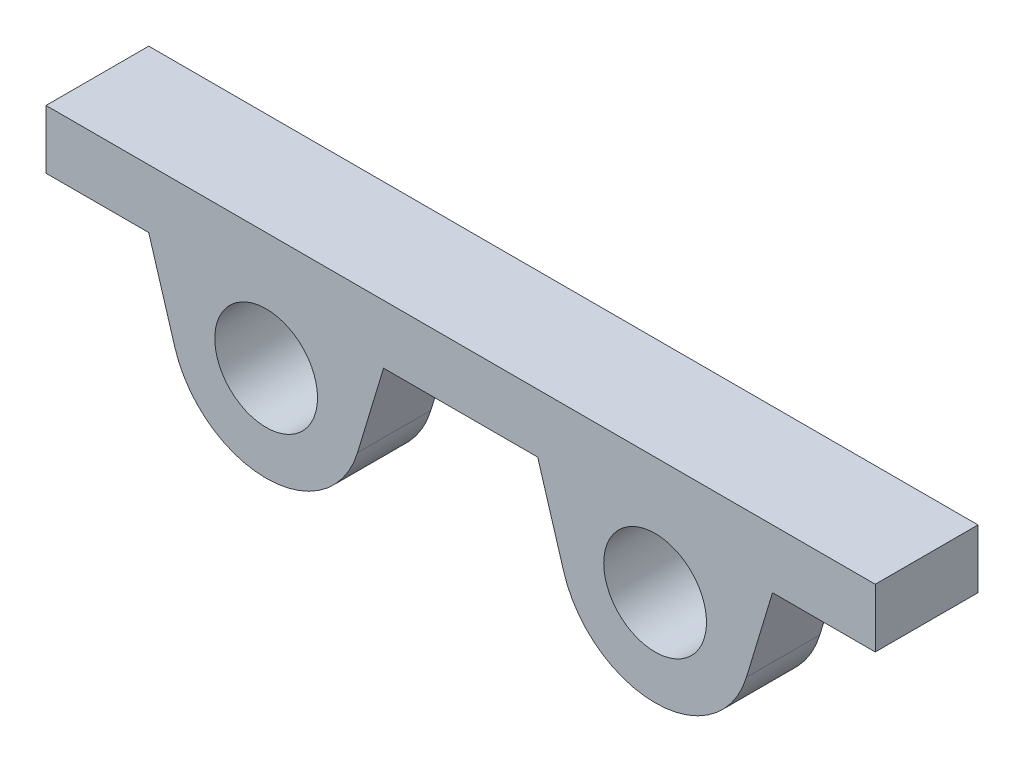
ISO-10303-21;
HEADER;
FILE_DESCRIPTION(('STEP AP214'),'2;1');
FILE_NAME('part.step','',(''),(''),'','','');
FILE_SCHEMA(('AUTOMOTIVE_DESIGN { 1 0 10303 214 1 1 1 1 }'));
ENDSEC;
DATA;
#1=APPLICATION_CONTEXT('core data for automotive mechanical design processes');
#2=APPLICATION_PROTOCOL_DEFINITION('international standard','automotive_design',2000,#1);
#3=PRODUCT_CONTEXT('',#1,'mechanical');
#4=PRODUCT('Part','Part','',(#3));
#5=PRODUCT_RELATED_PRODUCT_CATEGORY('part','',(#4));
#6=PRODUCT_DEFINITION_FORMATION('','',#4);
#7=PRODUCT_DEFINITION_CONTEXT('part definition',#1,'design');
#8=PRODUCT_DEFINITION('design','',#6,#7);
#9=PRODUCT_DEFINITION_SHAPE('','',#8);
#10=(LENGTH_UNIT() NAMED_UNIT(*) SI_UNIT(.MILLI.,.METRE.));
#11=(NAMED_UNIT(*) PLANE_ANGLE_UNIT() SI_UNIT($,.RADIAN.));
#12=(NAMED_UNIT(*) SI_UNIT($,.STERADIAN.) SOLID_ANGLE_UNIT());
#13=UNCERTAINTY_MEASURE_WITH_UNIT(LENGTH_MEASURE(1.E-05),#10,'distance_accuracy_value','');
#14=(GEOMETRIC_REPRESENTATION_CONTEXT(3) GLOBAL_UNCERTAINTY_ASSIGNED_CONTEXT((#13)) GLOBAL_UNIT_ASSIGNED_CONTEXT((#10,
#11,#12)) REPRESENTATION_CONTEXT('',''));
#15=CARTESIAN_POINT('',(0.,0.,0.));
#16=DIRECTION('',(0.,0.,1.));
#17=DIRECTION('',(1.,0.,0.));
#18=AXIS2_PLACEMENT_3D('',#15,#16,#17);
#19=CARTESIAN_POINT('',(-13.25,0.,-5.));
#20=DIRECTION('',(0.,0.,-1.));
#21=DIRECTION('',(1.,0.,0.));
#22=AXIS2_PLACEMENT_3D('',#19,#20,#21);
#23=PLANE('',#22);
#24=DIRECTION('',(1.,0.,0.));
#25=VECTOR('',#24,1.);
#26=CARTESIAN_POINT('',(28.25,4.,-5.));
#27=LINE('',#26,#25);
#28=CARTESIAN_POINT('',(-21.25,4.,-5.));
#29=VERTEX_POINT('',#28);
#30=CARTESIAN_POINT('',(-5.25,4.,-5.));
#31=VERTEX_POINT('',#30);
#32=EDGE_CURVE('E11',#29,#31,#27,.T.);
#33=ORIENTED_EDGE('',*,*,#32,.T.);
#34=DIRECTION('',(0.289410286372225,0.957205143186113,0.));
#35=VECTOR('',#34,1.);
#36=CARTESIAN_POINT('',(-7.02816656929026,-1.88116686141946,-5.));
#37=LINE('',#36,#35);
#38=CARTESIAN_POINT('',(-7.02816656929026,-1.88116686141946,-5.));
#39=VERTEX_POINT('',#38);
#40=EDGE_CURVE('E177',#39,#31,#37,.T.);
#41=ORIENTED_EDGE('',*,*,#40,.F.);
#42=CARTESIAN_POINT('',(-13.25,0.,-5.));
#43=DIRECTION('',(0.,0.,1.));
#44=DIRECTION('',(1.,0.,0.));
#45=AXIS2_PLACEMENT_3D('',#42,#43,#44);
#46=CIRCLE('',#45,6.5);
#47=CARTESIAN_POINT('',(-19.4718334307097,-1.88116686141946,-5.));
#48=VERTEX_POINT('',#47);
#49=EDGE_CURVE('E175',#48,#39,#46,.T.);
#50=ORIENTED_EDGE('',*,*,#49,.F.);
#51=DIRECTION('',(0.289410286372225,-0.957205143186113,0.));
#52=VECTOR('',#51,1.);
#53=CARTESIAN_POINT('',(-21.25,4.,-5.));
#54=LINE('',#53,#52);
#55=EDGE_CURVE('E141',#29,#48,#54,.T.);
#56=ORIENTED_EDGE('',*,*,#55,.F.);
#57=EDGE_LOOP('',(#33,#41,#50,#56));
#58=FACE_BOUND('',#57,.T.);
#59=CARTESIAN_POINT('',(-13.25,0.,-5.));
#60=DIRECTION('',(0.,0.,1.));
#61=DIRECTION('',(1.,0.,0.));
#62=AXIS2_PLACEMENT_3D('',#59,#60,#61);
#63=CIRCLE('',#62,3.5);
#64=CARTESIAN_POINT('',(-9.75,0.,-5.));
#65=VERTEX_POINT('',#64);
#66=EDGE_CURVE('E169',#65,#65,#63,.T.);
#67=ORIENTED_EDGE('',*,*,#66,.T.);
#68=EDGE_LOOP('',(#67));
#69=FACE_BOUND('',#68,.T.);
#70=ADVANCED_FACE('F35',(#58,#69),#23,.T.);
#71=CARTESIAN_POINT('',(5.25,4.,-5.));
#72=VERTEX_POINT('',#71);
#73=CARTESIAN_POINT('',(21.25,4.,-5.));
#74=VERTEX_POINT('',#73);
#75=EDGE_CURVE('E45',#72,#74,#27,.T.);
#76=ORIENTED_EDGE('',*,*,#75,.T.);
#77=DIRECTION('',(0.289410286372225,0.957205143186113,0.));
#78=VECTOR('',#77,1.);
#79=CARTESIAN_POINT('',(21.25,4.,-5.));
#80=LINE('',#79,#78);
#81=CARTESIAN_POINT('',(19.4718334307097,-1.88116686141946,-5.));
#82=VERTEX_POINT('',#81);
#83=EDGE_CURVE('E136',#82,#74,#80,.T.);
#84=ORIENTED_EDGE('',*,*,#83,.F.);
#85=CARTESIAN_POINT('',(13.25,0.,-5.));
#86=DIRECTION('',(0.,0.,1.));
#87=DIRECTION('',(-1.,0.,0.));
#88=AXIS2_PLACEMENT_3D('',#85,#86,#87);
#89=CIRCLE('',#88,6.5);
#90=CARTESIAN_POINT('',(7.02816656929026,-1.88116686141946,-5.));
#91=VERTEX_POINT('',#90);
#92=EDGE_CURVE('E142',#91,#82,#89,.T.);
#93=ORIENTED_EDGE('',*,*,#92,.F.);
#94=DIRECTION('',(0.289410286372225,-0.957205143186113,0.));
#95=VECTOR('',#94,1.);
#96=CARTESIAN_POINT('',(7.02816656929026,-1.88116686141946,-5.));
#97=LINE('',#96,#95);
#98=EDGE_CURVE('E148',#72,#91,#97,.T.);
#99=ORIENTED_EDGE('',*,*,#98,.F.);
#100=EDGE_LOOP('',(#76,#84,#93,#99));
#101=FACE_BOUND('',#100,.T.);
#102=CARTESIAN_POINT('',(13.25,0.,-5.));
#103=DIRECTION('',(0.,0.,1.));
#104=DIRECTION('',(-1.,0.,0.));
#105=AXIS2_PLACEMENT_3D('',#102,#103,#104);
#106=CIRCLE('',#105,3.5);
#107=CARTESIAN_POINT('',(9.75,0.,-5.));
#108=VERTEX_POINT('',#107);
#109=EDGE_CURVE('E163',#108,#108,#106,.T.);
#110=ORIENTED_EDGE('',*,*,#109,.T.);
#111=EDGE_LOOP('',(#110));
#112=FACE_BOUND('',#111,.T.);
#113=ADVANCED_FACE('F145',(#101,#112),#23,.T.);
#114=CARTESIAN_POINT('',(-13.25,0.,0.));
#115=DIRECTION('',(0.,0.,-1.));
#116=DIRECTION('',(1.,0.,0.));
#117=AXIS2_PLACEMENT_3D('',#114,#115,#116);
#118=PLANE('',#117);
#119=CARTESIAN_POINT('',(-13.25,0.,0.));
#120=DIRECTION('',(0.,0.,1.));
#121=DIRECTION('',(1.,0.,0.));
#122=AXIS2_PLACEMENT_3D('',#119,#120,#121);
#123=CIRCLE('',#122,6.5);
#124=CARTESIAN_POINT('',(-19.4718334307097,-1.88116686141946,0.));
#125=VERTEX_POINT('',#124);
#126=CARTESIAN_POINT('',(-7.02816656929026,-1.88116686141946,0.));
#127=VERTEX_POINT('',#126);
#128=EDGE_CURVE('E172',#125,#127,#123,.T.);
#129=ORIENTED_EDGE('',*,*,#128,.T.);
#130=DIRECTION('',(0.289410286372225,0.957205143186113,0.));
#131=VECTOR('',#130,1.);
#132=CARTESIAN_POINT('',(-7.02816656929026,-1.88116686141946,0.));
#133=LINE('',#132,#131);
#134=CARTESIAN_POINT('',(-5.25,4.,0.));
#135=VERTEX_POINT('',#134);
#136=EDGE_CURVE('E185',#127,#135,#133,.T.);
#137=ORIENTED_EDGE('',*,*,#136,.T.);
#138=DIRECTION('',(1.,0.,0.));
#139=VECTOR('',#138,1.);
#140=CARTESIAN_POINT('',(-5.25,4.,0.));
#141=LINE('',#140,#139);
#142=CARTESIAN_POINT('',(5.25,4.,0.));
#143=VERTEX_POINT('',#142);
#144=EDGE_CURVE('E188',#135,#143,#141,.T.);
#145=ORIENTED_EDGE('',*,*,#144,.T.);
#146=DIRECTION('',(0.289410286372225,-0.957205143186113,0.));
#147=VECTOR('',#146,1.);
#148=CARTESIAN_POINT('',(7.02816656929026,-1.88116686141946,0.));
#149=LINE('',#148,#147);
#150=CARTESIAN_POINT('',(7.02816656929026,-1.88116686141946,0.));
#151=VERTEX_POINT('',#150);
#152=EDGE_CURVE('E191',#143,#151,#149,.T.);
#153=ORIENTED_EDGE('',*,*,#152,.T.);
#154=CARTESIAN_POINT('',(13.25,0.,0.));
#155=DIRECTION('',(0.,0.,1.));
#156=DIRECTION('',(-1.,0.,0.));
#157=AXIS2_PLACEMENT_3D('',#154,#155,#156);
#158=CIRCLE('',#157,6.5);
#159=CARTESIAN_POINT('',(19.4718334307097,-1.88116686141946,0.));
#160=VERTEX_POINT('',#159);
#161=EDGE_CURVE('E194',#151,#160,#158,.T.);
#162=ORIENTED_EDGE('',*,*,#161,.T.);
#163=DIRECTION('',(0.289410286372225,0.957205143186113,0.));
#164=VECTOR('',#163,1.);
#165=CARTESIAN_POINT('',(21.25,4.,0.));
#166=LINE('',#165,#164);
#167=CARTESIAN_POINT('',(21.25,4.,0.));
#168=VERTEX_POINT('',#167);
#169=EDGE_CURVE('E197',#160,#168,#166,.T.);
#170=ORIENTED_EDGE('',*,*,#169,.T.);
#171=DIRECTION('',(1.,0.,0.));
#172=VECTOR('',#171,1.);
#173=CARTESIAN_POINT('',(28.25,4.,0.));
#174=LINE('',#173,#172);
#175=CARTESIAN_POINT('',(28.25,4.,0.));
#176=VERTEX_POINT('',#175);
#177=EDGE_CURVE('E128',#168,#176,#174,.T.);
#178=ORIENTED_EDGE('',*,*,#177,.T.);
#179=DIRECTION('',(0.,1.,0.));
#180=VECTOR('',#179,1.);
#181=CARTESIAN_POINT('',(28.25,8.,0.));
#182=LINE('',#181,#180);
#183=CARTESIAN_POINT('',(28.25,8.,0.));
#184=VERTEX_POINT('',#183);
#185=EDGE_CURVE('E200',#176,#184,#182,.T.);
#186=ORIENTED_EDGE('',*,*,#185,.T.);
#187=DIRECTION('',(-1.,0.,0.));
#188=VECTOR('',#187,1.);
#189=CARTESIAN_POINT('',(28.25,8.,0.));
#190=LINE('',#189,#188);
#191=CARTESIAN_POINT('',(-28.25,8.,0.));
#192=VERTEX_POINT('',#191);
#193=EDGE_CURVE('E203',#184,#192,#190,.T.);
#194=ORIENTED_EDGE('',*,*,#193,.T.);
#195=DIRECTION('',(0.,-1.,0.));
#196=VECTOR('',#195,1.);
#197=CARTESIAN_POINT('',(-28.25,8.,0.));
#198=LINE('',#197,#196);
#199=CARTESIAN_POINT('',(-28.25,4.,0.));
#200=VERTEX_POINT('',#199);
#201=EDGE_CURVE('E206',#192,#200,#198,.T.);
#202=ORIENTED_EDGE('',*,*,#201,.T.);
#203=DIRECTION('',(1.,0.,0.));
#204=VECTOR('',#203,1.);
#205=CARTESIAN_POINT('',(-28.25,4.,0.));
#206=LINE('',#205,#204);
#207=CARTESIAN_POINT('',(-21.25,4.,0.));
#208=VERTEX_POINT('',#207);
#209=EDGE_CURVE('E209',#200,#208,#206,.T.);
#210=ORIENTED_EDGE('',*,*,#209,.T.);
#211=DIRECTION('',(0.289410286372225,-0.957205143186113,0.));
#212=VECTOR('',#211,1.);
#213=CARTESIAN_POINT('',(-21.25,4.,0.));
#214=LINE('',#213,#212);
#215=EDGE_CURVE('E178',#208,#125,#214,.T.);
#216=ORIENTED_EDGE('',*,*,#215,.T.);
#217=EDGE_LOOP('',(#129,#137,#145,#153,#162,#170,#178,#186,#194,#202,#210,#216));
#218=FACE_BOUND('',#217,.T.);
#219=CARTESIAN_POINT('',(-13.25,0.,0.));
#220=DIRECTION('',(0.,0.,1.));
#221=DIRECTION('',(1.,0.,0.));
#222=AXIS2_PLACEMENT_3D('',#219,#220,#221);
#223=CIRCLE('',#222,3.5);
#224=CARTESIAN_POINT('',(-9.75,0.,0.));
#225=VERTEX_POINT('',#224);
#226=EDGE_CURVE('E166',#225,#225,#223,.T.);
#227=ORIENTED_EDGE('',*,*,#226,.F.);
#228=EDGE_LOOP('',(#227));
#229=FACE_BOUND('',#228,.T.);
#230=CARTESIAN_POINT('',(13.25,0.,0.));
#231=DIRECTION('',(0.,0.,1.));
#232=DIRECTION('',(-1.,0.,0.));
#233=AXIS2_PLACEMENT_3D('',#230,#231,#232);
#234=CIRCLE('',#233,3.5);
#235=CARTESIAN_POINT('',(9.75,0.,0.));
#236=VERTEX_POINT('',#235);
#237=EDGE_CURVE('E162',#236,#236,#234,.T.);
#238=ORIENTED_EDGE('',*,*,#237,.F.);
#239=EDGE_LOOP('',(#238));
#240=FACE_BOUND('',#239,.T.);
#241=ADVANCED_FACE('F231',(#218,#229,#240),#118,.F.);
#242=CARTESIAN_POINT('',(-13.25,0.,-5.));
#243=DIRECTION('',(0.,0.,1.));
#244=DIRECTION('',(-1.,0.,0.));
#245=AXIS2_PLACEMENT_3D('',#242,#243,#244);
#246=CYLINDRICAL_SURFACE('',#245,6.5);
#247=ORIENTED_EDGE('',*,*,#128,.F.);
#248=DIRECTION('',(0.,0.,1.));
#249=VECTOR('',#248,1.);
#250=CARTESIAN_POINT('',(-19.4718334307097,-1.88116686141946,-5.));
#251=LINE('',#250,#249);
#252=EDGE_CURVE('E54',#48,#125,#251,.T.);
#253=ORIENTED_EDGE('',*,*,#252,.F.);
#254=ORIENTED_EDGE('',*,*,#49,.T.);
#255=DIRECTION('',(0.,0.,1.));
#256=VECTOR('',#255,1.);
#257=CARTESIAN_POINT('',(-7.02816656929026,-1.88116686141946,-5.));
#258=LINE('',#257,#256);
#259=EDGE_CURVE('E39',#39,#127,#258,.T.);
#260=ORIENTED_EDGE('',*,*,#259,.T.);
#261=EDGE_LOOP('',(#247,#253,#254,#260));
#262=FACE_BOUND('',#261,.T.);
#263=ADVANCED_FACE('F37',(#262),#246,.T.);
#264=CARTESIAN_POINT('',(-7.02816656929026,-1.88116686141946,-5.));
#265=DIRECTION('',(-0.957205143186113,0.289410286372225,0.));
#266=DIRECTION('',(-0.289410286372225,-0.957205143186113,0.));
#267=AXIS2_PLACEMENT_3D('',#264,#265,#266);
#268=PLANE('',#267);
#269=ORIENTED_EDGE('',*,*,#136,.F.);
#270=ORIENTED_EDGE('',*,*,#259,.F.);
#271=ORIENTED_EDGE('',*,*,#40,.T.);
#272=DIRECTION('',(0.,0.,1.));
#273=VECTOR('',#272,1.);
#274=CARTESIAN_POINT('',(-5.25,4.,-5.));
#275=LINE('',#274,#273);
#276=EDGE_CURVE('E149',#31,#135,#275,.T.);
#277=ORIENTED_EDGE('',*,*,#276,.T.);
#278=EDGE_LOOP('',(#269,#270,#271,#277));
#279=FACE_BOUND('',#278,.T.);
#280=ADVANCED_FACE('F227',(#279),#268,.F.);
#281=CARTESIAN_POINT('',(7.02816656929026,-1.88116686141946,-5.));
#282=DIRECTION('',(0.957205143186113,0.289410286372225,0.));
#283=DIRECTION('',(-0.289410286372225,0.957205143186113,0.));
#284=AXIS2_PLACEMENT_3D('',#281,#282,#283);
#285=PLANE('',#284);
#286=ORIENTED_EDGE('',*,*,#152,.F.);
#287=DIRECTION('',(0.,0.,1.));
#288=VECTOR('',#287,1.);
#289=CARTESIAN_POINT('',(5.25,4.,-5.));
#290=LINE('',#289,#288);
#291=EDGE_CURVE('E225',#72,#143,#290,.T.);
#292=ORIENTED_EDGE('',*,*,#291,.F.);
#293=ORIENTED_EDGE('',*,*,#98,.T.);
#294=DIRECTION('',(0.,0.,1.));
#295=VECTOR('',#294,1.);
#296=CARTESIAN_POINT('',(7.02816656929026,-1.88116686141946,-5.));
#297=LINE('',#296,#295);
#298=EDGE_CURVE('E223',#91,#151,#297,.T.);
#299=ORIENTED_EDGE('',*,*,#298,.T.);
#300=EDGE_LOOP('',(#286,#292,#293,#299));
#301=FACE_BOUND('',#300,.T.);
#302=ADVANCED_FACE('F265',(#301),#285,.F.);
#303=CARTESIAN_POINT('',(13.25,0.,-5.));
#304=DIRECTION('',(0.,0.,1.));
#305=DIRECTION('',(-1.,0.,0.));
#306=AXIS2_PLACEMENT_3D('',#303,#304,#305);
#307=CYLINDRICAL_SURFACE('',#306,6.5);
#308=ORIENTED_EDGE('',*,*,#161,.F.);
#309=ORIENTED_EDGE('',*,*,#298,.F.);
#310=ORIENTED_EDGE('',*,*,#92,.T.);
#311=DIRECTION('',(0.,0.,1.));
#312=VECTOR('',#311,1.);
#313=CARTESIAN_POINT('',(19.4718334307097,-1.88116686141946,-5.));
#314=LINE('',#313,#312);
#315=EDGE_CURVE('E132',#82,#160,#314,.T.);
#316=ORIENTED_EDGE('',*,*,#315,.T.);
#317=EDGE_LOOP('',(#308,#309,#310,#316));
#318=FACE_BOUND('',#317,.T.);
#319=ADVANCED_FACE('F263',(#318),#307,.T.);
#320=CARTESIAN_POINT('',(21.25,4.,-5.));
#321=DIRECTION('',(-0.957205143186113,0.289410286372225,0.));
#322=DIRECTION('',(-0.289410286372225,-0.957205143186113,0.));
#323=AXIS2_PLACEMENT_3D('',#320,#321,#322);
#324=PLANE('',#323);
#325=ORIENTED_EDGE('',*,*,#169,.F.);
#326=ORIENTED_EDGE('',*,*,#315,.F.);
#327=ORIENTED_EDGE('',*,*,#83,.T.);
#328=DIRECTION('',(0.,0.,1.));
#329=VECTOR('',#328,1.);
#330=CARTESIAN_POINT('',(21.25,4.,-5.));
#331=LINE('',#330,#329);
#332=EDGE_CURVE('E123',#74,#168,#331,.T.);
#333=ORIENTED_EDGE('',*,*,#332,.T.);
#334=EDGE_LOOP('',(#325,#326,#327,#333));
#335=FACE_BOUND('',#334,.T.);
#336=ADVANCED_FACE('F137',(#335),#324,.F.);
#337=CARTESIAN_POINT('',(28.25,8.,-5.));
#338=DIRECTION('',(-1.,0.,0.));
#339=DIRECTION('',(0.,0.,-1.));
#340=AXIS2_PLACEMENT_3D('',#337,#338,#339);
#341=PLANE('',#340);
#342=ORIENTED_EDGE('',*,*,#185,.F.);
#343=DIRECTION('',(0.,0.,1.));
#344=VECTOR('',#343,1.);
#345=CARTESIAN_POINT('',(28.25,4.,-5.));
#346=LINE('',#345,#344);
#347=CARTESIAN_POINT('',(28.25,4.,-7.00000000000001));
#348=VERTEX_POINT('',#347);
#349=EDGE_CURVE('E133',#348,#176,#346,.T.);
#350=ORIENTED_EDGE('',*,*,#349,.F.);
#351=DIRECTION('',(0.,-1.,0.));
#352=VECTOR('',#351,1.);
#353=CARTESIAN_POINT('',(28.25,64.5353871482278,-7.00000000000001));
#354=LINE('',#353,#352);
#355=CARTESIAN_POINT('',(28.25,8.,-7.00000000000001));
#356=VERTEX_POINT('',#355);
#357=EDGE_CURVE('E157',#356,#348,#354,.T.);
#358=ORIENTED_EDGE('',*,*,#357,.F.);
#359=DIRECTION('',(0.,0.,1.));
#360=VECTOR('',#359,1.);
#361=CARTESIAN_POINT('',(28.25,8.,-5.));
#362=LINE('',#361,#360);
#363=EDGE_CURVE('E219',#356,#184,#362,.T.);
#364=ORIENTED_EDGE('',*,*,#363,.T.);
#365=EDGE_LOOP('',(#342,#350,#358,#364));
#366=FACE_BOUND('',#365,.T.);
#367=ADVANCED_FACE('F259',(#366),#341,.F.);
#368=CARTESIAN_POINT('',(28.25,8.,-5.));
#369=DIRECTION('',(0.,-1.,0.));
#370=DIRECTION('',(0.,0.,1.));
#371=AXIS2_PLACEMENT_3D('',#368,#369,#370);
#372=PLANE('',#371);
#373=ORIENTED_EDGE('',*,*,#193,.F.);
#374=ORIENTED_EDGE('',*,*,#363,.F.);
#375=DIRECTION('',(1.,0.,0.));
#376=VECTOR('',#375,1.);
#377=CARTESIAN_POINT('',(28.25,8.,-7.00000000000001));
#378=LINE('',#377,#376);
#379=CARTESIAN_POINT('',(-28.25,8.,-7.));
#380=VERTEX_POINT('',#379);
#381=EDGE_CURVE('E156',#380,#356,#378,.T.);
#382=ORIENTED_EDGE('',*,*,#381,.F.);
#383=DIRECTION('',(0.,0.,1.));
#384=VECTOR('',#383,1.);
#385=CARTESIAN_POINT('',(-28.25,8.,-5.));
#386=LINE('',#385,#384);
#387=EDGE_CURVE('E217',#380,#192,#386,.T.);
#388=ORIENTED_EDGE('',*,*,#387,.T.);
#389=EDGE_LOOP('',(#373,#374,#382,#388));
#390=FACE_BOUND('',#389,.T.);
#391=ADVANCED_FACE('F290',(#390),#372,.F.);
#392=CARTESIAN_POINT('',(-28.25,8.,-5.));
#393=DIRECTION('',(1.,0.,0.));
#394=DIRECTION('',(0.,0.,1.));
#395=AXIS2_PLACEMENT_3D('',#392,#393,#394);
#396=PLANE('',#395);
#397=ORIENTED_EDGE('',*,*,#201,.F.);
#398=ORIENTED_EDGE('',*,*,#387,.F.);
#399=DIRECTION('',(0.,-1.,0.));
#400=VECTOR('',#399,1.);
#401=CARTESIAN_POINT('',(-28.25,64.5353871482278,-7.));
#402=LINE('',#401,#400);
#403=CARTESIAN_POINT('',(-28.25,4.,-7.));
#404=VERTEX_POINT('',#403);
#405=EDGE_CURVE('E153',#380,#404,#402,.T.);
#406=ORIENTED_EDGE('',*,*,#405,.T.);
#407=DIRECTION('',(0.,0.,1.));
#408=VECTOR('',#407,1.);
#409=CARTESIAN_POINT('',(-28.25,4.,-5.));
#410=LINE('',#409,#408);
#411=EDGE_CURVE('E215',#404,#200,#410,.T.);
#412=ORIENTED_EDGE('',*,*,#411,.T.);
#413=EDGE_LOOP('',(#397,#398,#406,#412));
#414=FACE_BOUND('',#413,.T.);
#415=ADVANCED_FACE('F249',(#414),#396,.F.);
#416=CARTESIAN_POINT('',(-28.25,4.,-5.));
#417=DIRECTION('',(0.,1.,0.));
#418=DIRECTION('',(0.,0.,-1.));
#419=AXIS2_PLACEMENT_3D('',#416,#417,#418);
#420=PLANE('',#419);
#421=ORIENTED_EDGE('',*,*,#209,.F.);
#422=ORIENTED_EDGE('',*,*,#411,.F.);
#423=DIRECTION('',(-1.,0.,0.));
#424=VECTOR('',#423,1.);
#425=CARTESIAN_POINT('',(28.25,4.,-7.00000000000001));
#426=LINE('',#425,#424);
#427=EDGE_CURVE('E152',#348,#404,#426,.T.);
#428=ORIENTED_EDGE('',*,*,#427,.F.);
#429=ORIENTED_EDGE('',*,*,#349,.T.);
#430=ORIENTED_EDGE('',*,*,#177,.F.);
#431=ORIENTED_EDGE('',*,*,#332,.F.);
#432=ORIENTED_EDGE('',*,*,#75,.F.);
#433=ORIENTED_EDGE('',*,*,#291,.T.);
#434=ORIENTED_EDGE('',*,*,#144,.F.);
#435=ORIENTED_EDGE('',*,*,#276,.F.);
#436=ORIENTED_EDGE('',*,*,#32,.F.);
#437=DIRECTION('',(0.,0.,1.));
#438=VECTOR('',#437,1.);
#439=CARTESIAN_POINT('',(-21.25,4.,-5.));
#440=LINE('',#439,#438);
#441=EDGE_CURVE('E96',#29,#208,#440,.T.);
#442=ORIENTED_EDGE('',*,*,#441,.T.);
#443=EDGE_LOOP('',(#421,#422,#428,#429,#430,#431,#432,#433,#434,#435,#436,#442));
#444=FACE_BOUND('',#443,.T.);
#445=ADVANCED_FACE('F125',(#444),#420,.F.);
#446=CARTESIAN_POINT('',(-21.25,4.,-5.));
#447=DIRECTION('',(0.957205143186113,0.289410286372225,0.));
#448=DIRECTION('',(-0.289410286372225,0.957205143186113,0.));
#449=AXIS2_PLACEMENT_3D('',#446,#447,#448);
#450=PLANE('',#449);
#451=ORIENTED_EDGE('',*,*,#215,.F.);
#452=ORIENTED_EDGE('',*,*,#441,.F.);
#453=ORIENTED_EDGE('',*,*,#55,.T.);
#454=ORIENTED_EDGE('',*,*,#252,.T.);
#455=EDGE_LOOP('',(#451,#452,#453,#454));
#456=FACE_BOUND('',#455,.T.);
#457=ADVANCED_FACE('F237',(#456),#450,.F.);
#458=CARTESIAN_POINT('',(-13.25,0.,-5.));
#459=DIRECTION('',(0.,0.,1.));
#460=DIRECTION('',(-1.,0.,0.));
#461=AXIS2_PLACEMENT_3D('',#458,#459,#460);
#462=CYLINDRICAL_SURFACE('',#461,3.5);
#463=ORIENTED_EDGE('',*,*,#66,.F.);
#464=EDGE_LOOP('',(#463));
#465=FACE_BOUND('',#464,.T.);
#466=ORIENTED_EDGE('',*,*,#226,.T.);
#467=EDGE_LOOP('',(#466));
#468=FACE_BOUND('',#467,.T.);
#469=ADVANCED_FACE('F280',(#465,#468),#462,.F.);
#470=CARTESIAN_POINT('',(13.25,0.,-5.));
#471=DIRECTION('',(0.,0.,1.));
#472=DIRECTION('',(-1.,0.,0.));
#473=AXIS2_PLACEMENT_3D('',#470,#471,#472);
#474=CYLINDRICAL_SURFACE('',#473,3.5);
#475=ORIENTED_EDGE('',*,*,#109,.F.);
#476=EDGE_LOOP('',(#475));
#477=FACE_BOUND('',#476,.T.);
#478=ORIENTED_EDGE('',*,*,#237,.T.);
#479=EDGE_LOOP('',(#478));
#480=FACE_BOUND('',#479,.T.);
#481=ADVANCED_FACE('F327',(#477,#480),#474,.F.);
#482=CARTESIAN_POINT('',(28.25,64.5353871482278,-7.00000000000001));
#483=DIRECTION('',(0.,0.,-1.));
#484=DIRECTION('',(1.,0.,0.));
#485=AXIS2_PLACEMENT_3D('',#482,#483,#484);
#486=PLANE('',#485);
#487=ORIENTED_EDGE('',*,*,#381,.T.);
#488=ORIENTED_EDGE('',*,*,#357,.T.);
#489=ORIENTED_EDGE('',*,*,#427,.T.);
#490=ORIENTED_EDGE('',*,*,#405,.F.);
#491=EDGE_LOOP('',(#487,#488,#489,#490));
#492=FACE_BOUND('',#491,.T.);
#493=ADVANCED_FACE('F252',(#492),#486,.T.);
#494=CLOSED_SHELL('',(#70,#113,#241,#263,#280,#302,#319,#336,#367,#391,#415,#445,#457,#469,#481,#493));
#495=MANIFOLD_SOLID_BREP('B2',#494);
#496=ADVANCED_BREP_SHAPE_REPRESENTATION('',(#18,#495),#14);
#497=SHAPE_DEFINITION_REPRESENTATION(#9,#496);
ENDSEC;
END-ISO-10303-21;
